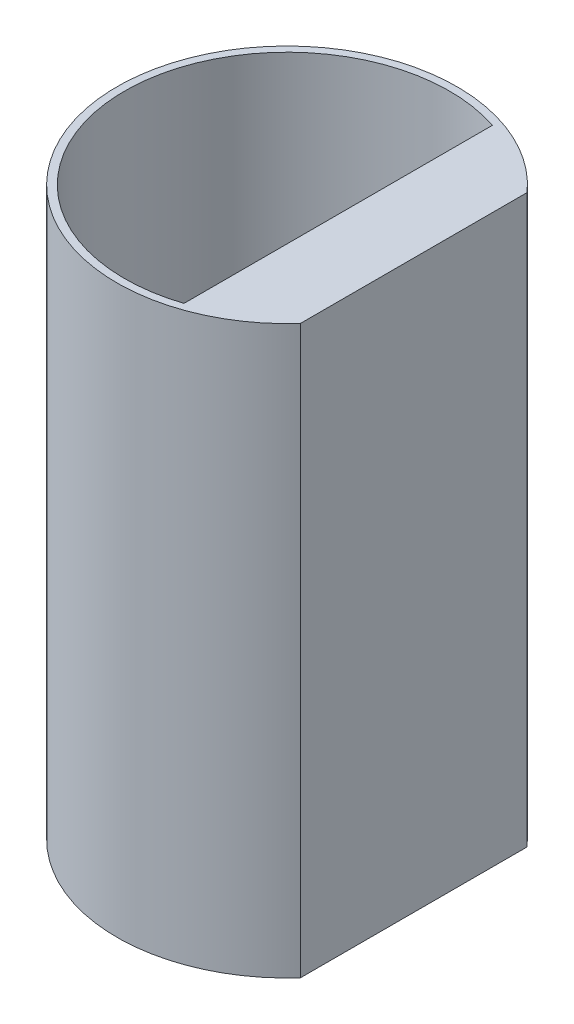
ISO-10303-21;
HEADER;
FILE_DESCRIPTION(('STEP AP214'),'2;1');
FILE_NAME('part.step','',(''),(''),'','','');
FILE_SCHEMA(('AUTOMOTIVE_DESIGN { 1 0 10303 214 1 1 1 1 }'));
ENDSEC;
DATA;
#1=APPLICATION_CONTEXT('core data for automotive mechanical design processes');
#2=APPLICATION_PROTOCOL_DEFINITION('international standard','automotive_design',2000,#1);
#3=PRODUCT_CONTEXT('',#1,'mechanical');
#4=PRODUCT('Part','Part','',(#3));
#5=PRODUCT_RELATED_PRODUCT_CATEGORY('part','',(#4));
#6=PRODUCT_DEFINITION_FORMATION('','',#4);
#7=PRODUCT_DEFINITION_CONTEXT('part definition',#1,'design');
#8=PRODUCT_DEFINITION('design','',#6,#7);
#9=PRODUCT_DEFINITION_SHAPE('','',#8);
#10=(LENGTH_UNIT() NAMED_UNIT(*) SI_UNIT(.MILLI.,.METRE.));
#11=(NAMED_UNIT(*) PLANE_ANGLE_UNIT() SI_UNIT($,.RADIAN.));
#12=(NAMED_UNIT(*) SI_UNIT($,.STERADIAN.) SOLID_ANGLE_UNIT());
#13=UNCERTAINTY_MEASURE_WITH_UNIT(LENGTH_MEASURE(1.E-05),#10,'distance_accuracy_value','');
#14=(GEOMETRIC_REPRESENTATION_CONTEXT(3) GLOBAL_UNCERTAINTY_ASSIGNED_CONTEXT((#13)) GLOBAL_UNIT_ASSIGNED_CONTEXT((#10,
#11,#12)) REPRESENTATION_CONTEXT('',''));
#15=CARTESIAN_POINT('',(0.,0.,0.));
#16=DIRECTION('',(0.,0.,1.));
#17=DIRECTION('',(1.,0.,0.));
#18=AXIS2_PLACEMENT_3D('',#15,#16,#17);
#19=CARTESIAN_POINT('',(0.,75.,0.));
#20=DIRECTION('',(0.,-1.,0.));
#21=DIRECTION('',(0.,0.,-1.));
#22=AXIS2_PLACEMENT_3D('',#19,#20,#21);
#23=CYLINDRICAL_SURFACE('',#22,22.5);
#24=CARTESIAN_POINT('',(0.,0.,0.));
#25=DIRECTION('',(0.,1.,0.));
#26=DIRECTION('',(0.,0.,1.));
#27=AXIS2_PLACEMENT_3D('',#24,#25,#26);
#28=CIRCLE('',#27,22.5);
#29=CARTESIAN_POINT('',(16.7705098312484,0.,-15.));
#30=VERTEX_POINT('',#29);
#31=CARTESIAN_POINT('',(16.7705098312484,0.,15.));
#32=VERTEX_POINT('',#31);
#33=EDGE_CURVE('E75',#30,#32,#28,.T.);
#34=ORIENTED_EDGE('',*,*,#33,.T.);
#35=DIRECTION('',(0.,-1.,0.));
#36=VECTOR('',#35,1.);
#37=CARTESIAN_POINT('',(16.7705098312484,75.,15.));
#38=LINE('',#37,#36);
#39=CARTESIAN_POINT('',(16.7705098312484,75.,15.));
#40=VERTEX_POINT('',#39);
#41=EDGE_CURVE('E11',#40,#32,#38,.T.);
#42=ORIENTED_EDGE('',*,*,#41,.F.);
#43=CARTESIAN_POINT('',(0.,75.,0.));
#44=DIRECTION('',(0.,1.,0.));
#45=DIRECTION('',(0.,0.,1.));
#46=AXIS2_PLACEMENT_3D('',#43,#44,#45);
#47=CIRCLE('',#46,22.5);
#48=CARTESIAN_POINT('',(16.7705098312484,75.,-15.));
#49=VERTEX_POINT('',#48);
#50=EDGE_CURVE('E74',#49,#40,#47,.T.);
#51=ORIENTED_EDGE('',*,*,#50,.F.);
#52=DIRECTION('',(0.,-1.,0.));
#53=VECTOR('',#52,1.);
#54=CARTESIAN_POINT('',(16.7705098312484,75.,-15.));
#55=LINE('',#54,#53);
#56=EDGE_CURVE('E40',#49,#30,#55,.T.);
#57=ORIENTED_EDGE('',*,*,#56,.T.);
#58=EDGE_LOOP('',(#34,#42,#51,#57));
#59=FACE_BOUND('',#58,.T.);
#60=ADVANCED_FACE('F33',(#59),#23,.T.);
#61=CARTESIAN_POINT('',(16.7705098312484,75.,-15.));
#62=DIRECTION('',(-1.,0.,0.));
#63=DIRECTION('',(0.,0.,1.));
#64=AXIS2_PLACEMENT_3D('',#61,#62,#63);
#65=PLANE('',#64);
#66=DIRECTION('',(0.,0.,-1.));
#67=VECTOR('',#66,1.);
#68=CARTESIAN_POINT('',(16.7705098312484,0.,-15.));
#69=LINE('',#68,#67);
#70=EDGE_CURVE('E66',#32,#30,#69,.T.);
#71=ORIENTED_EDGE('',*,*,#70,.T.);
#72=ORIENTED_EDGE('',*,*,#56,.F.);
#73=DIRECTION('',(0.,0.,-1.));
#74=VECTOR('',#73,1.);
#75=CARTESIAN_POINT('',(16.7705098312484,75.,-15.));
#76=LINE('',#75,#74);
#77=EDGE_CURVE('E55',#40,#49,#76,.T.);
#78=ORIENTED_EDGE('',*,*,#77,.F.);
#79=ORIENTED_EDGE('',*,*,#41,.T.);
#80=EDGE_LOOP('',(#71,#72,#78,#79));
#81=FACE_BOUND('',#80,.T.);
#82=ADVANCED_FACE('F68',(#81),#65,.F.);
#83=CARTESIAN_POINT('',(0.,75.,0.));
#84=DIRECTION('',(0.,1.,0.));
#85=DIRECTION('',(0.,0.,1.));
#86=AXIS2_PLACEMENT_3D('',#83,#84,#85);
#87=PLANE('',#86);
#88=CARTESIAN_POINT('',(0.,75.,0.));
#89=DIRECTION('',(0.,1.,0.));
#90=DIRECTION('',(0.,0.,1.));
#91=AXIS2_PLACEMENT_3D('',#88,#89,#90);
#92=CIRCLE('',#91,21.5);
#93=CARTESIAN_POINT('',(6.77050983124842,75.,-20.406131348812));
#94=VERTEX_POINT('',#93);
#95=CARTESIAN_POINT('',(6.77050983124842,75.,20.406131348812));
#96=VERTEX_POINT('',#95);
#97=EDGE_CURVE('E87',#94,#96,#92,.T.);
#98=ORIENTED_EDGE('',*,*,#97,.F.);
#99=DIRECTION('',(0.,0.,-1.));
#100=VECTOR('',#99,1.);
#101=CARTESIAN_POINT('',(6.77050983124842,75.,-15.));
#102=LINE('',#101,#100);
#103=EDGE_CURVE('E85',#96,#94,#102,.T.);
#104=ORIENTED_EDGE('',*,*,#103,.F.);
#105=EDGE_LOOP('',(#98,#104));
#106=FACE_BOUND('',#105,.T.);
#107=ORIENTED_EDGE('',*,*,#50,.T.);
#108=ORIENTED_EDGE('',*,*,#77,.T.);
#109=EDGE_LOOP('',(#107,#108));
#110=FACE_BOUND('',#109,.T.);
#111=ADVANCED_FACE('F110',(#106,#110),#87,.T.);
#112=CARTESIAN_POINT('',(0.,0.,0.));
#113=DIRECTION('',(0.,1.,0.));
#114=DIRECTION('',(0.,0.,1.));
#115=AXIS2_PLACEMENT_3D('',#112,#113,#114);
#116=PLANE('',#115);
#117=ORIENTED_EDGE('',*,*,#33,.F.);
#118=ORIENTED_EDGE('',*,*,#70,.F.);
#119=EDGE_LOOP('',(#117,#118));
#120=FACE_BOUND('',#119,.T.);
#121=ADVANCED_FACE('F78',(#120),#116,.F.);
#122=CARTESIAN_POINT('',(0.,75.,0.));
#123=DIRECTION('',(0.,-1.,0.));
#124=DIRECTION('',(0.,0.,-1.));
#125=AXIS2_PLACEMENT_3D('',#122,#123,#124);
#126=CYLINDRICAL_SURFACE('',#125,21.5);
#127=CARTESIAN_POINT('',(0.,5.,0.));
#128=DIRECTION('',(0.,1.,0.));
#129=DIRECTION('',(0.,0.,1.));
#130=AXIS2_PLACEMENT_3D('',#127,#128,#129);
#131=CIRCLE('',#130,21.5);
#132=CARTESIAN_POINT('',(6.77050983124842,5.,-20.406131348812));
#133=VERTEX_POINT('',#132);
#134=CARTESIAN_POINT('',(6.77050983124842,5.,20.406131348812));
#135=VERTEX_POINT('',#134);
#136=EDGE_CURVE('E92',#133,#135,#131,.T.);
#137=ORIENTED_EDGE('',*,*,#136,.F.);
#138=DIRECTION('',(0.,-1.,0.));
#139=VECTOR('',#138,1.);
#140=CARTESIAN_POINT('',(6.77050983124842,75.,-20.406131348812));
#141=LINE('',#140,#139);
#142=EDGE_CURVE('E80',#94,#133,#141,.T.);
#143=ORIENTED_EDGE('',*,*,#142,.F.);
#144=ORIENTED_EDGE('',*,*,#97,.T.);
#145=DIRECTION('',(0.,-1.,0.));
#146=VECTOR('',#145,1.);
#147=CARTESIAN_POINT('',(6.77050983124842,75.,20.406131348812));
#148=LINE('',#147,#146);
#149=EDGE_CURVE('E47',#96,#135,#148,.T.);
#150=ORIENTED_EDGE('',*,*,#149,.T.);
#151=EDGE_LOOP('',(#137,#143,#144,#150));
#152=FACE_BOUND('',#151,.T.);
#153=ADVANCED_FACE('F104',(#152),#126,.F.);
#154=CARTESIAN_POINT('',(6.77050983124842,75.,-15.));
#155=DIRECTION('',(-1.,0.,0.));
#156=DIRECTION('',(0.,0.,1.));
#157=AXIS2_PLACEMENT_3D('',#154,#155,#156);
#158=PLANE('',#157);
#159=DIRECTION('',(0.,0.,-1.));
#160=VECTOR('',#159,1.);
#161=CARTESIAN_POINT('',(6.77050983124842,5.,-15.));
#162=LINE('',#161,#160);
#163=EDGE_CURVE('E89',#135,#133,#162,.T.);
#164=ORIENTED_EDGE('',*,*,#163,.F.);
#165=ORIENTED_EDGE('',*,*,#149,.F.);
#166=ORIENTED_EDGE('',*,*,#103,.T.);
#167=ORIENTED_EDGE('',*,*,#142,.T.);
#168=EDGE_LOOP('',(#164,#165,#166,#167));
#169=FACE_BOUND('',#168,.T.);
#170=ADVANCED_FACE('F108',(#169),#158,.T.);
#171=CARTESIAN_POINT('',(0.,5.,0.));
#172=DIRECTION('',(0.,1.,0.));
#173=DIRECTION('',(0.,0.,1.));
#174=AXIS2_PLACEMENT_3D('',#171,#172,#173);
#175=PLANE('',#174);
#176=ORIENTED_EDGE('',*,*,#136,.T.);
#177=ORIENTED_EDGE('',*,*,#163,.T.);
#178=EDGE_LOOP('',(#176,#177));
#179=FACE_BOUND('',#178,.T.);
#180=ADVANCED_FACE('F99',(#179),#175,.T.);
#181=CLOSED_SHELL('',(#60,#82,#111,#121,#153,#170,#180));
#182=MANIFOLD_SOLID_BREP('B2',#181);
#183=ADVANCED_BREP_SHAPE_REPRESENTATION('',(#18,#182),#14);
#184=SHAPE_DEFINITION_REPRESENTATION(#9,#183);
ENDSEC;
END-ISO-10303-21;
